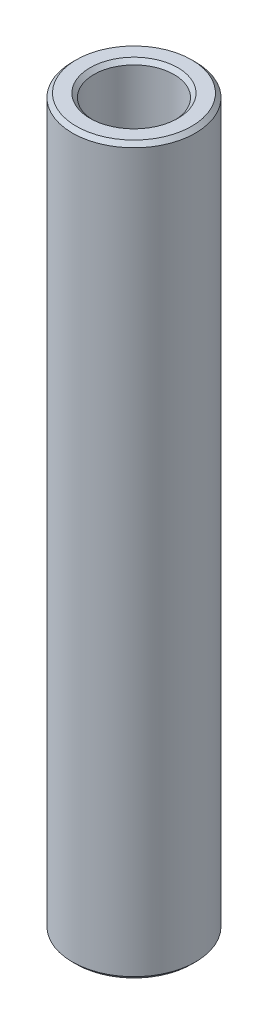
ISO-10303-21;
HEADER;
FILE_DESCRIPTION(('STEP AP214'),'2;1');
FILE_NAME('part.step','',(''),(''),'','','');
FILE_SCHEMA(('AUTOMOTIVE_DESIGN { 1 0 10303 214 1 1 1 1 }'));
ENDSEC;
DATA;
#1=APPLICATION_CONTEXT('core data for automotive mechanical design processes');
#2=APPLICATION_PROTOCOL_DEFINITION('international standard','automotive_design',2000,#1);
#3=PRODUCT_CONTEXT('',#1,'mechanical');
#4=PRODUCT('Part','Part','',(#3));
#5=PRODUCT_RELATED_PRODUCT_CATEGORY('part','',(#4));
#6=PRODUCT_DEFINITION_FORMATION('','',#4);
#7=PRODUCT_DEFINITION_CONTEXT('part definition',#1,'design');
#8=PRODUCT_DEFINITION('design','',#6,#7);
#9=PRODUCT_DEFINITION_SHAPE('','',#8);
#10=(LENGTH_UNIT() NAMED_UNIT(*) SI_UNIT(.MILLI.,.METRE.));
#11=(NAMED_UNIT(*) PLANE_ANGLE_UNIT() SI_UNIT($,.RADIAN.));
#12=(NAMED_UNIT(*) SI_UNIT($,.STERADIAN.) SOLID_ANGLE_UNIT());
#13=UNCERTAINTY_MEASURE_WITH_UNIT(LENGTH_MEASURE(1.E-05),#10,'distance_accuracy_value','');
#14=(GEOMETRIC_REPRESENTATION_CONTEXT(3) GLOBAL_UNCERTAINTY_ASSIGNED_CONTEXT((#13)) GLOBAL_UNIT_ASSIGNED_CONTEXT((#10,
#11,#12)) REPRESENTATION_CONTEXT('',''));
#15=CARTESIAN_POINT('',(0.,0.,0.));
#16=DIRECTION('',(0.,0.,1.));
#17=DIRECTION('',(1.,0.,0.));
#18=AXIS2_PLACEMENT_3D('',#15,#16,#17);
#19=CARTESIAN_POINT('',(0.,9.6155583234771,0.));
#20=DIRECTION('',(0.,1.,0.));
#21=DIRECTION('',(0.,0.,1.));
#22=AXIS2_PLACEMENT_3D('',#19,#20,#21);
#23=CYLINDRICAL_SURFACE('',#22,1.3);
#24=CARTESIAN_POINT('',(0.,-11.65987,0.));
#25=DIRECTION('',(0.,1.,0.));
#26=DIRECTION('',(0.,0.,1.));
#27=AXIS2_PLACEMENT_3D('',#24,#25,#26);
#28=CIRCLE('',#27,1.3);
#29=CARTESIAN_POINT('',(0.,-11.65987,1.3));
#30=VERTEX_POINT('',#29);
#31=EDGE_CURVE('E50',#30,#30,#28,.F.);
#32=ORIENTED_EDGE('',*,*,#31,.T.);
#33=EDGE_LOOP('',(#32));
#34=FACE_BOUND('',#33,.T.);
#35=CARTESIAN_POINT('',(0.,11.65987,0.));
#36=DIRECTION('',(0.,-1.,0.));
#37=DIRECTION('',(0.,0.,-1.));
#38=AXIS2_PLACEMENT_3D('',#35,#36,#37);
#39=CIRCLE('',#38,1.3);
#40=CARTESIAN_POINT('',(0.,11.65987,-1.3));
#41=VERTEX_POINT('',#40);
#42=EDGE_CURVE('E53',#41,#41,#39,.F.);
#43=ORIENTED_EDGE('',*,*,#42,.T.);
#44=EDGE_LOOP('',(#43));
#45=FACE_BOUND('',#44,.T.);
#46=ADVANCED_FACE('F30',(#34,#45),#23,.F.);
#47=CARTESIAN_POINT('',(1.3,-11.78687,0.));
#48=DIRECTION('',(0.,1.,0.));
#49=DIRECTION('',(0.,0.,1.));
#50=AXIS2_PLACEMENT_3D('',#47,#48,#49);
#51=PLANE('',#50);
#52=CARTESIAN_POINT('',(0.,-11.78687,0.));
#53=DIRECTION('',(0.,1.,0.));
#54=DIRECTION('',(0.,0.,1.));
#55=AXIS2_PLACEMENT_3D('',#52,#53,#54);
#56=CIRCLE('',#55,1.427);
#57=CARTESIAN_POINT('',(0.,-11.78687,1.427));
#58=VERTEX_POINT('',#57);
#59=EDGE_CURVE('E56',#58,#58,#56,.T.);
#60=ORIENTED_EDGE('',*,*,#59,.T.);
#61=EDGE_LOOP('',(#60));
#62=FACE_BOUND('',#61,.T.);
#63=CARTESIAN_POINT('',(0.,-11.78687,0.));
#64=DIRECTION('',(0.,1.,0.));
#65=DIRECTION('',(0.,0.,1.));
#66=AXIS2_PLACEMENT_3D('',#63,#64,#65);
#67=CIRCLE('',#66,1.873);
#68=CARTESIAN_POINT('',(0.,-11.78687,1.873));
#69=VERTEX_POINT('',#68);
#70=EDGE_CURVE('E59',#69,#69,#67,.F.);
#71=ORIENTED_EDGE('',*,*,#70,.T.);
#72=EDGE_LOOP('',(#71));
#73=FACE_BOUND('',#72,.T.);
#74=ADVANCED_FACE('F63',(#62,#73),#51,.F.);
#75=CARTESIAN_POINT('',(0.,9.6155583234771,0.));
#76=DIRECTION('',(0.,1.,0.));
#77=DIRECTION('',(0.,0.,1.));
#78=AXIS2_PLACEMENT_3D('',#75,#76,#77);
#79=CYLINDRICAL_SURFACE('',#78,2.);
#80=CARTESIAN_POINT('',(0.,-11.65987,0.));
#81=DIRECTION('',(0.,1.,0.));
#82=DIRECTION('',(0.,0.,1.));
#83=AXIS2_PLACEMENT_3D('',#80,#81,#82);
#84=CIRCLE('',#83,2.);
#85=CARTESIAN_POINT('',(0.,-11.65987,2.));
#86=VERTEX_POINT('',#85);
#87=EDGE_CURVE('E41',#86,#86,#84,.T.);
#88=ORIENTED_EDGE('',*,*,#87,.T.);
#89=EDGE_LOOP('',(#88));
#90=FACE_BOUND('',#89,.T.);
#91=CARTESIAN_POINT('',(0.,11.65987,0.));
#92=DIRECTION('',(0.,-1.,0.));
#93=DIRECTION('',(0.,0.,-1.));
#94=AXIS2_PLACEMENT_3D('',#91,#92,#93);
#95=CIRCLE('',#94,2.);
#96=CARTESIAN_POINT('',(0.,11.65987,-2.));
#97=VERTEX_POINT('',#96);
#98=EDGE_CURVE('E45',#97,#97,#95,.T.);
#99=ORIENTED_EDGE('',*,*,#98,.T.);
#100=EDGE_LOOP('',(#99));
#101=FACE_BOUND('',#100,.T.);
#102=ADVANCED_FACE('F73',(#90,#101),#79,.T.);
#103=CARTESIAN_POINT('',(2.,11.78687,0.));
#104=DIRECTION('',(0.,-1.,0.));
#105=DIRECTION('',(0.,0.,-1.));
#106=AXIS2_PLACEMENT_3D('',#103,#104,#105);
#107=PLANE('',#106);
#108=CARTESIAN_POINT('',(0.,11.78687,0.));
#109=DIRECTION('',(0.,-1.,0.));
#110=DIRECTION('',(0.,0.,-1.));
#111=AXIS2_PLACEMENT_3D('',#108,#109,#110);
#112=CIRCLE('',#111,1.873);
#113=CARTESIAN_POINT('',(0.,11.78687,-1.873));
#114=VERTEX_POINT('',#113);
#115=EDGE_CURVE('E10',#114,#114,#112,.F.);
#116=ORIENTED_EDGE('',*,*,#115,.T.);
#117=EDGE_LOOP('',(#116));
#118=FACE_BOUND('',#117,.T.);
#119=CARTESIAN_POINT('',(0.,11.78687,0.));
#120=DIRECTION('',(0.,-1.,0.));
#121=DIRECTION('',(0.,0.,-1.));
#122=AXIS2_PLACEMENT_3D('',#119,#120,#121);
#123=CIRCLE('',#122,1.427);
#124=CARTESIAN_POINT('',(0.,11.78687,-1.427));
#125=VERTEX_POINT('',#124);
#126=EDGE_CURVE('E37',#125,#125,#123,.T.);
#127=ORIENTED_EDGE('',*,*,#126,.T.);
#128=EDGE_LOOP('',(#127));
#129=FACE_BOUND('',#128,.T.);
#130=ADVANCED_FACE('F76',(#118,#129),#107,.F.);
#131=CARTESIAN_POINT('',(0.,-11.78687,0.));
#132=DIRECTION('',(0.,-1.,0.));
#133=DIRECTION('',(0.,0.,-1.));
#134=AXIS2_PLACEMENT_3D('',#131,#132,#133);
#135=CONICAL_SURFACE('',#134,1.427,0.785398163397448);
#136=ORIENTED_EDGE('',*,*,#31,.F.);
#137=EDGE_LOOP('',(#136));
#138=FACE_BOUND('',#137,.T.);
#139=ORIENTED_EDGE('',*,*,#59,.F.);
#140=EDGE_LOOP('',(#139));
#141=FACE_BOUND('',#140,.T.);
#142=ADVANCED_FACE('F69',(#138,#141),#135,.F.);
#143=CARTESIAN_POINT('',(0.,-11.65987,0.));
#144=DIRECTION('',(0.,1.,0.));
#145=DIRECTION('',(0.,0.,1.));
#146=AXIS2_PLACEMENT_3D('',#143,#144,#145);
#147=CONICAL_SURFACE('',#146,2.,0.785398163397452);
#148=ORIENTED_EDGE('',*,*,#70,.F.);
#149=EDGE_LOOP('',(#148));
#150=FACE_BOUND('',#149,.T.);
#151=ORIENTED_EDGE('',*,*,#87,.F.);
#152=EDGE_LOOP('',(#151));
#153=FACE_BOUND('',#152,.T.);
#154=ADVANCED_FACE('F65',(#150,#153),#147,.T.);
#155=CARTESIAN_POINT('',(0.,11.78687,0.));
#156=DIRECTION('',(0.,-1.,0.));
#157=DIRECTION('',(0.,0.,-1.));
#158=AXIS2_PLACEMENT_3D('',#155,#156,#157);
#159=CONICAL_SURFACE('',#158,1.873,0.785398163397452);
#160=ORIENTED_EDGE('',*,*,#98,.F.);
#161=EDGE_LOOP('',(#160));
#162=FACE_BOUND('',#161,.T.);
#163=ORIENTED_EDGE('',*,*,#115,.F.);
#164=EDGE_LOOP('',(#163));
#165=FACE_BOUND('',#164,.T.);
#166=ADVANCED_FACE('F68',(#162,#165),#159,.T.);
#167=CARTESIAN_POINT('',(0.,11.65987,0.));
#168=DIRECTION('',(0.,1.,0.));
#169=DIRECTION('',(0.,0.,1.));
#170=AXIS2_PLACEMENT_3D('',#167,#168,#169);
#171=CONICAL_SURFACE('',#170,1.3,0.785398163397455);
#172=ORIENTED_EDGE('',*,*,#126,.F.);
#173=EDGE_LOOP('',(#172));
#174=FACE_BOUND('',#173,.T.);
#175=ORIENTED_EDGE('',*,*,#42,.F.);
#176=EDGE_LOOP('',(#175));
#177=FACE_BOUND('',#176,.T.);
#178=ADVANCED_FACE('F32',(#174,#177),#171,.F.);
#179=CLOSED_SHELL('',(#46,#74,#102,#130,#142,#154,#166,#178));
#180=MANIFOLD_SOLID_BREP('B2',#179);
#181=ADVANCED_BREP_SHAPE_REPRESENTATION('',(#18,#180),#14);
#182=SHAPE_DEFINITION_REPRESENTATION(#9,#181);
ENDSEC;
END-ISO-10303-21;
